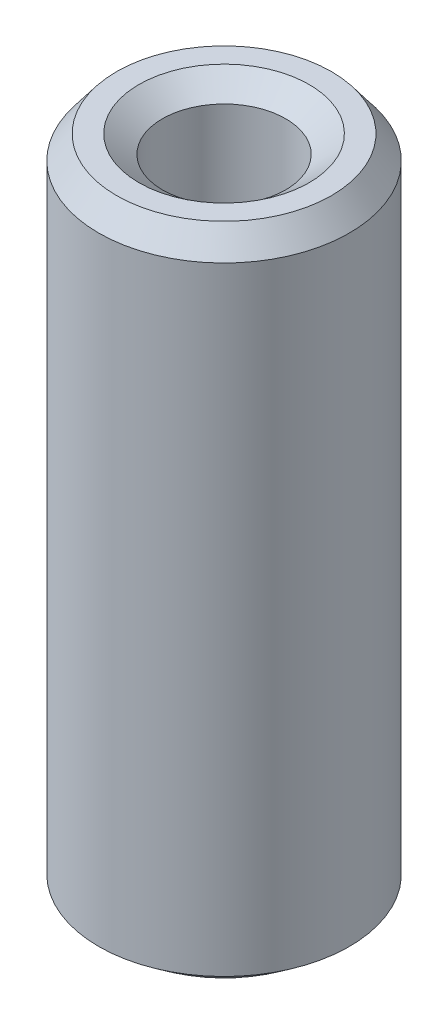
ISO-10303-21;
HEADER;
FILE_DESCRIPTION(('STEP AP214'),'2;1');
FILE_NAME('part.step','',(''),(''),'','','');
FILE_SCHEMA(('AUTOMOTIVE_DESIGN { 1 0 10303 214 1 1 1 1 }'));
ENDSEC;
DATA;
#1=APPLICATION_CONTEXT('core data for automotive mechanical design processes');
#2=APPLICATION_PROTOCOL_DEFINITION('international standard','automotive_design',2000,#1);
#3=PRODUCT_CONTEXT('',#1,'mechanical');
#4=PRODUCT('Part','Part','',(#3));
#5=PRODUCT_RELATED_PRODUCT_CATEGORY('part','',(#4));
#6=PRODUCT_DEFINITION_FORMATION('','',#4);
#7=PRODUCT_DEFINITION_CONTEXT('part definition',#1,'design');
#8=PRODUCT_DEFINITION('design','',#6,#7);
#9=PRODUCT_DEFINITION_SHAPE('','',#8);
#10=(LENGTH_UNIT() NAMED_UNIT(*) SI_UNIT(.MILLI.,.METRE.));
#11=(NAMED_UNIT(*) PLANE_ANGLE_UNIT() SI_UNIT($,.RADIAN.));
#12=(NAMED_UNIT(*) SI_UNIT($,.STERADIAN.) SOLID_ANGLE_UNIT());
#13=UNCERTAINTY_MEASURE_WITH_UNIT(LENGTH_MEASURE(1.E-05),#10,'distance_accuracy_value','');
#14=(GEOMETRIC_REPRESENTATION_CONTEXT(3) GLOBAL_UNCERTAINTY_ASSIGNED_CONTEXT((#13)) GLOBAL_UNIT_ASSIGNED_CONTEXT((#10,
#11,#12)) REPRESENTATION_CONTEXT('',''));
#15=CARTESIAN_POINT('',(0.,0.,0.));
#16=DIRECTION('',(0.,0.,1.));
#17=DIRECTION('',(1.,0.,0.));
#18=AXIS2_PLACEMENT_3D('',#15,#16,#17);
#19=CARTESIAN_POINT('',(0.,65.7405972560086,0.));
#20=DIRECTION('',(0.,-1.,0.));
#21=DIRECTION('',(0.,0.,-1.));
#22=AXIS2_PLACEMENT_3D('',#19,#20,#21);
#23=CYLINDRICAL_SURFACE('',#22,12.5);
#24=CARTESIAN_POINT('',(0.,1.78602773010181,0.));
#25=DIRECTION('',(0.,1.,0.));
#26=DIRECTION('',(0.,0.,1.));
#27=AXIS2_PLACEMENT_3D('',#24,#25,#26);
#28=CIRCLE('',#27,12.5);
#29=CARTESIAN_POINT('',(0.,1.78602773010181,12.5));
#30=VERTEX_POINT('',#29);
#31=EDGE_CURVE('E10',#30,#30,#28,.T.);
#32=ORIENTED_EDGE('',*,*,#31,.T.);
#33=EDGE_LOOP('',(#32));
#34=FACE_BOUND('',#33,.T.);
#35=CARTESIAN_POINT('',(0.,63.4004440295949,0.));
#36=DIRECTION('',(0.,1.,0.));
#37=DIRECTION('',(0.,0.,1.));
#38=AXIS2_PLACEMENT_3D('',#35,#36,#37);
#39=CIRCLE('',#38,12.5);
#40=CARTESIAN_POINT('',(0.,63.4004440295949,12.5));
#41=VERTEX_POINT('',#40);
#42=EDGE_CURVE('E50',#41,#41,#39,.F.);
#43=ORIENTED_EDGE('',*,*,#42,.T.);
#44=EDGE_LOOP('',(#43));
#45=FACE_BOUND('',#44,.T.);
#46=ADVANCED_FACE('F39',(#34,#45),#23,.T.);
#47=CARTESIAN_POINT('',(0.,65.7405972560086,0.));
#48=DIRECTION('',(0.,1.,0.));
#49=DIRECTION('',(0.,0.,1.));
#50=AXIS2_PLACEMENT_3D('',#47,#48,#49);
#51=PLANE('',#50);
#52=CARTESIAN_POINT('',(0.,65.7405972560086,0.));
#53=DIRECTION('',(0.,1.,0.));
#54=DIRECTION('',(0.,0.,1.));
#55=AXIS2_PLACEMENT_3D('',#52,#53,#54);
#56=CIRCLE('',#55,8.48783318016994);
#57=CARTESIAN_POINT('',(0.,65.7405972560086,8.48783318016994));
#58=VERTEX_POINT('',#57);
#59=EDGE_CURVE('E58',#58,#58,#56,.F.);
#60=ORIENTED_EDGE('',*,*,#59,.T.);
#61=EDGE_LOOP('',(#60));
#62=FACE_BOUND('',#61,.T.);
#63=CARTESIAN_POINT('',(0.,65.7405972560086,0.));
#64=DIRECTION('',(0.,1.,0.));
#65=DIRECTION('',(0.,0.,1.));
#66=AXIS2_PLACEMENT_3D('',#63,#64,#65);
#67=CIRCLE('',#66,10.7139722698982);
#68=CARTESIAN_POINT('',(0.,65.7405972560086,10.7139722698982));
#69=VERTEX_POINT('',#68);
#70=EDGE_CURVE('E61',#69,#69,#67,.T.);
#71=ORIENTED_EDGE('',*,*,#70,.T.);
#72=EDGE_LOOP('',(#71));
#73=FACE_BOUND('',#72,.T.);
#74=ADVANCED_FACE('F88',(#62,#73),#51,.T.);
#75=CARTESIAN_POINT('',(0.,0.,0.));
#76=DIRECTION('',(0.,1.,0.));
#77=DIRECTION('',(0.,0.,1.));
#78=AXIS2_PLACEMENT_3D('',#75,#76,#77);
#79=PLANE('',#78);
#80=CARTESIAN_POINT('',(0.,0.,0.));
#81=DIRECTION('',(0.,1.,0.));
#82=DIRECTION('',(0.,0.,1.));
#83=AXIS2_PLACEMENT_3D('',#80,#81,#82);
#84=CIRCLE('',#83,7.93370768385804);
#85=CARTESIAN_POINT('',(0.,0.,7.93370768385804));
#86=VERTEX_POINT('',#85);
#87=EDGE_CURVE('E51',#86,#86,#84,.T.);
#88=ORIENTED_EDGE('',*,*,#87,.T.);
#89=EDGE_LOOP('',(#88));
#90=FACE_BOUND('',#89,.T.);
#91=CARTESIAN_POINT('',(0.,0.,0.));
#92=DIRECTION('',(0.,1.,0.));
#93=DIRECTION('',(0.,0.,1.));
#94=AXIS2_PLACEMENT_3D('',#91,#92,#93);
#95=CIRCLE('',#94,10.1598467735863);
#96=CARTESIAN_POINT('',(0.,0.,10.1598467735863));
#97=VERTEX_POINT('',#96);
#98=EDGE_CURVE('E54',#97,#97,#95,.F.);
#99=ORIENTED_EDGE('',*,*,#98,.T.);
#100=EDGE_LOOP('',(#99));
#101=FACE_BOUND('',#100,.T.);
#102=ADVANCED_FACE('F83',(#90,#101),#79,.F.);
#103=CARTESIAN_POINT('',(0.,65.7405972560086,0.));
#104=DIRECTION('',(0.,-1.,0.));
#105=DIRECTION('',(0.,0.,-1.));
#106=AXIS2_PLACEMENT_3D('',#103,#104,#105);
#107=CYLINDRICAL_SURFACE('',#106,6.14767995375624);
#108=CARTESIAN_POINT('',(0.,63.9545695259068,0.));
#109=DIRECTION('',(0.,1.,0.));
#110=DIRECTION('',(0.,0.,1.));
#111=AXIS2_PLACEMENT_3D('',#108,#109,#110);
#112=CIRCLE('',#111,6.14767995375624);
#113=CARTESIAN_POINT('',(0.,63.9545695259068,6.14767995375624));
#114=VERTEX_POINT('',#113);
#115=EDGE_CURVE('E67',#114,#114,#112,.T.);
#116=ORIENTED_EDGE('',*,*,#115,.T.);
#117=EDGE_LOOP('',(#116));
#118=FACE_BOUND('',#117,.T.);
#119=CARTESIAN_POINT('',(0.,2.34015322641369,0.));
#120=DIRECTION('',(0.,1.,0.));
#121=DIRECTION('',(0.,0.,1.));
#122=AXIS2_PLACEMENT_3D('',#119,#120,#121);
#123=CIRCLE('',#122,6.14767995375624);
#124=CARTESIAN_POINT('',(0.,2.34015322641369,6.14767995375624));
#125=VERTEX_POINT('',#124);
#126=EDGE_CURVE('E69',#125,#125,#123,.F.);
#127=ORIENTED_EDGE('',*,*,#126,.T.);
#128=EDGE_LOOP('',(#127));
#129=FACE_BOUND('',#128,.T.);
#130=ADVANCED_FACE('F71',(#118,#129),#107,.F.);
#131=CARTESIAN_POINT('',(0.,63.9545695259068,0.));
#132=DIRECTION('',(0.,1.,0.));
#133=DIRECTION('',(0.,0.,1.));
#134=AXIS2_PLACEMENT_3D('',#131,#132,#133);
#135=CONICAL_SURFACE('',#134,6.14767995375624,0.918894451280282);
#136=ORIENTED_EDGE('',*,*,#59,.F.);
#137=EDGE_LOOP('',(#136));
#138=FACE_BOUND('',#137,.T.);
#139=ORIENTED_EDGE('',*,*,#115,.F.);
#140=EDGE_LOOP('',(#139));
#141=FACE_BOUND('',#140,.T.);
#142=ADVANCED_FACE('F77',(#138,#141),#135,.F.);
#143=CARTESIAN_POINT('',(0.,0.,0.));
#144=DIRECTION('',(0.,-1.,0.));
#145=DIRECTION('',(0.,0.,-1.));
#146=AXIS2_PLACEMENT_3D('',#143,#144,#145);
#147=CONICAL_SURFACE('',#146,7.93370768385804,0.651901875514615);
#148=ORIENTED_EDGE('',*,*,#126,.F.);
#149=EDGE_LOOP('',(#148));
#150=FACE_BOUND('',#149,.T.);
#151=ORIENTED_EDGE('',*,*,#87,.F.);
#152=EDGE_LOOP('',(#151));
#153=FACE_BOUND('',#152,.T.);
#154=ADVANCED_FACE('F73',(#150,#153),#147,.F.);
#155=CARTESIAN_POINT('',(0.,1.78602773010181,0.));
#156=DIRECTION('',(0.,1.,0.));
#157=DIRECTION('',(0.,0.,1.));
#158=AXIS2_PLACEMENT_3D('',#155,#156,#157);
#159=CONICAL_SURFACE('',#158,12.5,0.918894451280279);
#160=ORIENTED_EDGE('',*,*,#98,.F.);
#161=EDGE_LOOP('',(#160));
#162=FACE_BOUND('',#161,.T.);
#163=ORIENTED_EDGE('',*,*,#31,.F.);
#164=EDGE_LOOP('',(#163));
#165=FACE_BOUND('',#164,.T.);
#166=ADVANCED_FACE('F76',(#162,#165),#159,.T.);
#167=CARTESIAN_POINT('',(0.,65.7405972560086,0.));
#168=DIRECTION('',(0.,-1.,0.));
#169=DIRECTION('',(0.,0.,-1.));
#170=AXIS2_PLACEMENT_3D('',#167,#168,#169);
#171=CONICAL_SURFACE('',#170,10.7139722698982,0.651901875514616);
#172=ORIENTED_EDGE('',*,*,#42,.F.);
#173=EDGE_LOOP('',(#172));
#174=FACE_BOUND('',#173,.T.);
#175=ORIENTED_EDGE('',*,*,#70,.F.);
#176=EDGE_LOOP('',(#175));
#177=FACE_BOUND('',#176,.T.);
#178=ADVANCED_FACE('F45',(#174,#177),#171,.T.);
#179=CLOSED_SHELL('',(#46,#74,#102,#130,#142,#154,#166,#178));
#180=MANIFOLD_SOLID_BREP('B2',#179);
#181=ADVANCED_BREP_SHAPE_REPRESENTATION('',(#18,#180),#14);
#182=SHAPE_DEFINITION_REPRESENTATION(#9,#181);
ENDSEC;
END-ISO-10303-21;
